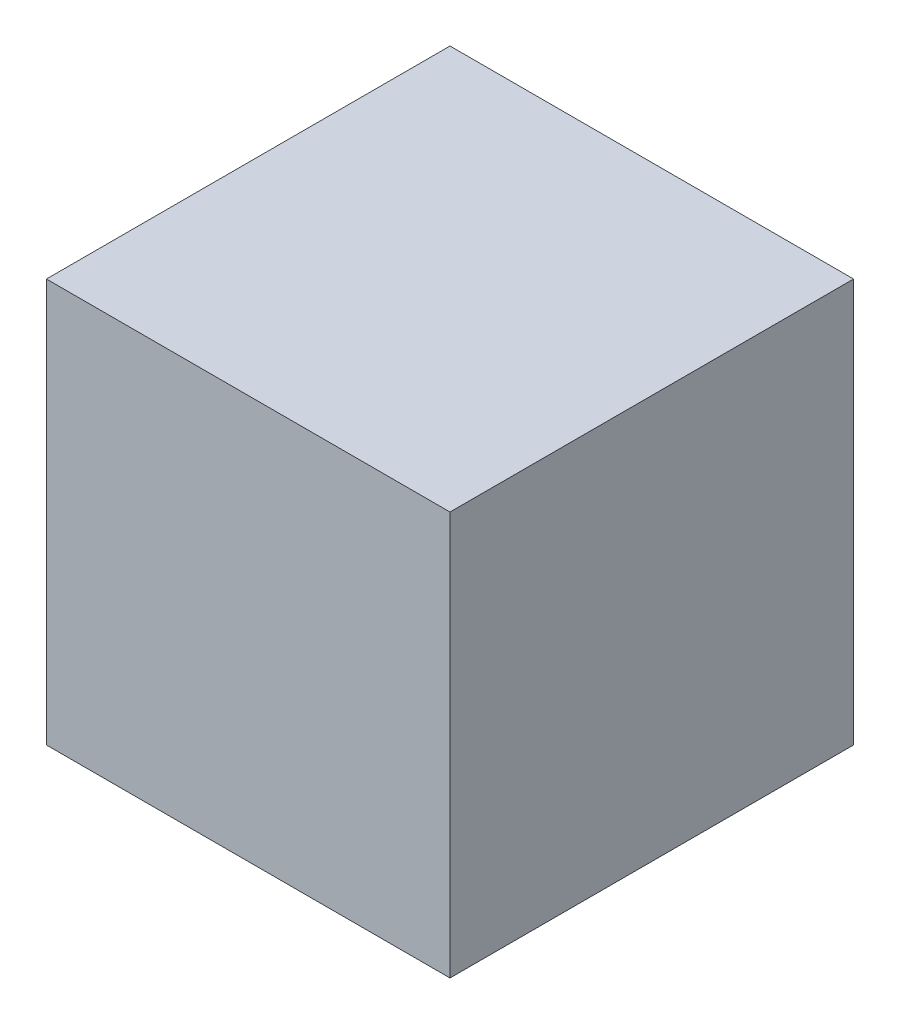
ISO-10303-21;
HEADER;
FILE_DESCRIPTION(('STEP AP214'),'2;1');
FILE_NAME('part.step','',(''),(''),'','','');
FILE_SCHEMA(('AUTOMOTIVE_DESIGN { 1 0 10303 214 1 1 1 1 }'));
ENDSEC;
DATA;
#1=APPLICATION_CONTEXT('core data for automotive mechanical design processes');
#2=APPLICATION_PROTOCOL_DEFINITION('international standard','automotive_design',2000,#1);
#3=PRODUCT_CONTEXT('',#1,'mechanical');
#4=PRODUCT('Part','Part','',(#3));
#5=PRODUCT_RELATED_PRODUCT_CATEGORY('part','',(#4));
#6=PRODUCT_DEFINITION_FORMATION('','',#4);
#7=PRODUCT_DEFINITION_CONTEXT('part definition',#1,'design');
#8=PRODUCT_DEFINITION('design','',#6,#7);
#9=PRODUCT_DEFINITION_SHAPE('','',#8);
#10=(LENGTH_UNIT() NAMED_UNIT(*) SI_UNIT(.MILLI.,.METRE.));
#11=(NAMED_UNIT(*) PLANE_ANGLE_UNIT() SI_UNIT($,.RADIAN.));
#12=(NAMED_UNIT(*) SI_UNIT($,.STERADIAN.) SOLID_ANGLE_UNIT());
#13=UNCERTAINTY_MEASURE_WITH_UNIT(LENGTH_MEASURE(1.E-05),#10,'distance_accuracy_value','');
#14=(GEOMETRIC_REPRESENTATION_CONTEXT(3) GLOBAL_UNCERTAINTY_ASSIGNED_CONTEXT((#13)) GLOBAL_UNIT_ASSIGNED_CONTEXT((#10,
#11,#12)) REPRESENTATION_CONTEXT('',''));
#15=CARTESIAN_POINT('',(0.,0.,0.));
#16=DIRECTION('',(0.,0.,1.));
#17=DIRECTION('',(1.,0.,0.));
#18=AXIS2_PLACEMENT_3D('',#15,#16,#17);
#19=CARTESIAN_POINT('',(0.79375,0.79375,0.79375));
#20=DIRECTION('',(0.,0.,-1.));
#21=DIRECTION('',(0.,1.,0.));
#22=AXIS2_PLACEMENT_3D('',#19,#20,#21);
#23=PLANE('',#22);
#24=DIRECTION('',(0.,-1.,0.));
#25=VECTOR('',#24,1.);
#26=CARTESIAN_POINT('',(-0.79375,0.79375,0.79375));
#27=LINE('',#26,#25);
#28=CARTESIAN_POINT('',(-0.79375,0.79375,0.79375));
#29=VERTEX_POINT('',#28);
#30=CARTESIAN_POINT('',(-0.79375,-0.79375,0.79375));
#31=VERTEX_POINT('',#30);
#32=EDGE_CURVE('E416',#29,#31,#27,.T.);
#33=ORIENTED_EDGE('',*,*,#32,.T.);
#34=DIRECTION('',(-1.,0.,0.));
#35=VECTOR('',#34,1.);
#36=CARTESIAN_POINT('',(0.79375,-0.79375,0.79375));
#37=LINE('',#36,#35);
#38=CARTESIAN_POINT('',(0.79375,-0.79375,0.79375));
#39=VERTEX_POINT('',#38);
#40=EDGE_CURVE('E11',#39,#31,#37,.T.);
#41=ORIENTED_EDGE('',*,*,#40,.F.);
#42=DIRECTION('',(0.,-1.,0.));
#43=VECTOR('',#42,1.);
#44=CARTESIAN_POINT('',(0.79375,0.79375,0.79375));
#45=LINE('',#44,#43);
#46=CARTESIAN_POINT('',(0.79375,0.79375,0.79375));
#47=VERTEX_POINT('',#46);
#48=EDGE_CURVE('E434',#47,#39,#45,.T.);
#49=ORIENTED_EDGE('',*,*,#48,.F.);
#50=DIRECTION('',(-1.,0.,0.));
#51=VECTOR('',#50,1.);
#52=CARTESIAN_POINT('',(0.79375,0.79375,0.79375));
#53=LINE('',#52,#51);
#54=EDGE_CURVE('E428',#47,#29,#53,.T.);
#55=ORIENTED_EDGE('',*,*,#54,.T.);
#56=EDGE_LOOP('',(#33,#41,#49,#55));
#57=FACE_BOUND('',#56,.T.);
#58=ADVANCED_FACE('F372',(#57),#23,.F.);
#59=CARTESIAN_POINT('',(0.79375,-0.79375,0.79375));
#60=DIRECTION('',(0.,1.,0.));
#61=DIRECTION('',(0.,0.,1.));
#62=AXIS2_PLACEMENT_3D('',#59,#60,#61);
#63=PLANE('',#62);
#64=DIRECTION('',(0.,0.,-1.));
#65=VECTOR('',#64,1.);
#66=CARTESIAN_POINT('',(-0.79375,-0.79375,0.79375));
#67=LINE('',#66,#65);
#68=CARTESIAN_POINT('',(-0.79375,-0.79375,-0.79375));
#69=VERTEX_POINT('',#68);
#70=EDGE_CURVE('E412',#31,#69,#67,.T.);
#71=ORIENTED_EDGE('',*,*,#70,.T.);
#72=DIRECTION('',(-1.,0.,0.));
#73=VECTOR('',#72,1.);
#74=CARTESIAN_POINT('',(0.79375,-0.79375,-0.79375));
#75=LINE('',#74,#73);
#76=CARTESIAN_POINT('',(0.79375,-0.79375,-0.79375));
#77=VERTEX_POINT('',#76);
#78=EDGE_CURVE('E379',#77,#69,#75,.T.);
#79=ORIENTED_EDGE('',*,*,#78,.F.);
#80=DIRECTION('',(0.,0.,-1.));
#81=VECTOR('',#80,1.);
#82=CARTESIAN_POINT('',(0.79375,-0.79375,0.79375));
#83=LINE('',#82,#81);
#84=EDGE_CURVE('E424',#39,#77,#83,.T.);
#85=ORIENTED_EDGE('',*,*,#84,.F.);
#86=ORIENTED_EDGE('',*,*,#40,.T.);
#87=EDGE_LOOP('',(#71,#79,#85,#86));
#88=FACE_BOUND('',#87,.T.);
#89=ADVANCED_FACE('F423',(#88),#63,.F.);
#90=CARTESIAN_POINT('',(0.79375,0.79375,-0.79375));
#91=DIRECTION('',(0.,0.,1.));
#92=DIRECTION('',(0.,-1.,0.));
#93=AXIS2_PLACEMENT_3D('',#90,#91,#92);
#94=PLANE('',#93);
#95=DIRECTION('',(0.,1.,0.));
#96=VECTOR('',#95,1.);
#97=CARTESIAN_POINT('',(-0.79375,0.79375,-0.79375));
#98=LINE('',#97,#96);
#99=CARTESIAN_POINT('',(-0.79375,0.79375,-0.79375));
#100=VERTEX_POINT('',#99);
#101=EDGE_CURVE('E417',#69,#100,#98,.T.);
#102=ORIENTED_EDGE('',*,*,#101,.T.);
#103=DIRECTION('',(-1.,0.,0.));
#104=VECTOR('',#103,1.);
#105=CARTESIAN_POINT('',(0.79375,0.79375,-0.79375));
#106=LINE('',#105,#104);
#107=CARTESIAN_POINT('',(0.79375,0.79375,-0.79375));
#108=VERTEX_POINT('',#107);
#109=EDGE_CURVE('E440',#108,#100,#106,.T.);
#110=ORIENTED_EDGE('',*,*,#109,.F.);
#111=DIRECTION('',(0.,1.,0.));
#112=VECTOR('',#111,1.);
#113=CARTESIAN_POINT('',(0.79375,0.79375,-0.79375));
#114=LINE('',#113,#112);
#115=EDGE_CURVE('E391',#77,#108,#114,.T.);
#116=ORIENTED_EDGE('',*,*,#115,.F.);
#117=ORIENTED_EDGE('',*,*,#78,.T.);
#118=EDGE_LOOP('',(#102,#110,#116,#117));
#119=FACE_BOUND('',#118,.T.);
#120=ADVANCED_FACE('F443',(#119),#94,.F.);
#121=CARTESIAN_POINT('',(0.79375,0.79375,0.79375));
#122=DIRECTION('',(0.,-1.,0.));
#123=DIRECTION('',(0.,0.,-1.));
#124=AXIS2_PLACEMENT_3D('',#121,#122,#123);
#125=PLANE('',#124);
#126=DIRECTION('',(0.,0.,1.));
#127=VECTOR('',#126,1.);
#128=CARTESIAN_POINT('',(-0.79375,0.79375,0.79375));
#129=LINE('',#128,#127);
#130=EDGE_CURVE('E432',#100,#29,#129,.T.);
#131=ORIENTED_EDGE('',*,*,#130,.T.);
#132=ORIENTED_EDGE('',*,*,#54,.F.);
#133=DIRECTION('',(0.,0.,1.));
#134=VECTOR('',#133,1.);
#135=CARTESIAN_POINT('',(0.79375,0.79375,0.79375));
#136=LINE('',#135,#134);
#137=EDGE_CURVE('E386',#108,#47,#136,.T.);
#138=ORIENTED_EDGE('',*,*,#137,.F.);
#139=ORIENTED_EDGE('',*,*,#109,.T.);
#140=EDGE_LOOP('',(#131,#132,#138,#139));
#141=FACE_BOUND('',#140,.T.);
#142=ADVANCED_FACE('F445',(#141),#125,.F.);
#143=CARTESIAN_POINT('',(0.79375,-0.79375,0.79375));
#144=DIRECTION('',(1.,0.,0.));
#145=DIRECTION('',(0.,0.,-1.));
#146=AXIS2_PLACEMENT_3D('',#143,#144,#145);
#147=PLANE('',#146);
#148=ORIENTED_EDGE('',*,*,#48,.T.);
#149=ORIENTED_EDGE('',*,*,#84,.T.);
#150=ORIENTED_EDGE('',*,*,#115,.T.);
#151=ORIENTED_EDGE('',*,*,#137,.T.);
#152=EDGE_LOOP('',(#148,#149,#150,#151));
#153=FACE_BOUND('',#152,.T.);
#154=ADVANCED_FACE('F446',(#153),#147,.T.);
#155=CARTESIAN_POINT('',(-0.79375,-0.79375,0.79375));
#156=DIRECTION('',(1.,0.,0.));
#157=DIRECTION('',(0.,0.,-1.));
#158=AXIS2_PLACEMENT_3D('',#155,#156,#157);
#159=PLANE('',#158);
#160=ORIENTED_EDGE('',*,*,#32,.F.);
#161=ORIENTED_EDGE('',*,*,#130,.F.);
#162=ORIENTED_EDGE('',*,*,#101,.F.);
#163=ORIENTED_EDGE('',*,*,#70,.F.);
#164=EDGE_LOOP('',(#160,#161,#162,#163));
#165=FACE_BOUND('',#164,.T.);
#166=ADVANCED_FACE('F413',(#165),#159,.F.);
#167=CLOSED_SHELL('',(#58,#89,#120,#142,#154,#166));
#168=MANIFOLD_SOLID_BREP('B2',#167);
#169=ADVANCED_BREP_SHAPE_REPRESENTATION('',(#18,#168),#14);
#170=SHAPE_DEFINITION_REPRESENTATION(#9,#169);
ENDSEC;
END-ISO-10303-21;
